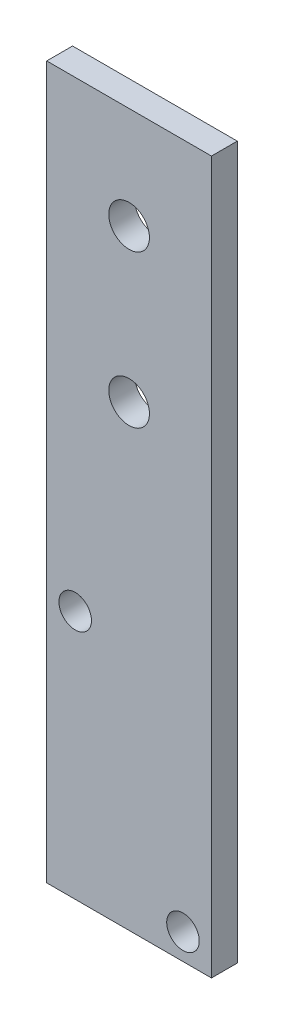
ISO-10303-21;
HEADER;
FILE_DESCRIPTION(('STEP AP214'),'2;1');
FILE_NAME('part.step','',(''),(''),'','','');
FILE_SCHEMA(('AUTOMOTIVE_DESIGN { 1 0 10303 214 1 1 1 1 }'));
ENDSEC;
DATA;
#1=APPLICATION_CONTEXT('core data for automotive mechanical design processes');
#2=APPLICATION_PROTOCOL_DEFINITION('international standard','automotive_design',2000,#1);
#3=PRODUCT_CONTEXT('',#1,'mechanical');
#4=PRODUCT('Part','Part','',(#3));
#5=PRODUCT_RELATED_PRODUCT_CATEGORY('part','',(#4));
#6=PRODUCT_DEFINITION_FORMATION('','',#4);
#7=PRODUCT_DEFINITION_CONTEXT('part definition',#1,'design');
#8=PRODUCT_DEFINITION('design','',#6,#7);
#9=PRODUCT_DEFINITION_SHAPE('','',#8);
#10=(LENGTH_UNIT() NAMED_UNIT(*) SI_UNIT(.MILLI.,.METRE.));
#11=(NAMED_UNIT(*) PLANE_ANGLE_UNIT() SI_UNIT($,.RADIAN.));
#12=(NAMED_UNIT(*) SI_UNIT($,.STERADIAN.) SOLID_ANGLE_UNIT());
#13=UNCERTAINTY_MEASURE_WITH_UNIT(LENGTH_MEASURE(1.E-05),#10,'distance_accuracy_value','');
#14=(GEOMETRIC_REPRESENTATION_CONTEXT(3) GLOBAL_UNCERTAINTY_ASSIGNED_CONTEXT((#13)) GLOBAL_UNIT_ASSIGNED_CONTEXT((#10,
#11,#12)) REPRESENTATION_CONTEXT('',''));
#15=CARTESIAN_POINT('',(0.,0.,0.));
#16=DIRECTION('',(0.,0.,1.));
#17=DIRECTION('',(1.,0.,0.));
#18=AXIS2_PLACEMENT_3D('',#15,#16,#17);
#19=CARTESIAN_POINT('',(0.,0.,2.54));
#20=DIRECTION('',(1.,0.,0.));
#21=DIRECTION('',(0.,0.,-1.));
#22=AXIS2_PLACEMENT_3D('',#19,#20,#21);
#23=PLANE('',#22);
#24=DIRECTION('',(0.,-1.,0.));
#25=VECTOR('',#24,1.);
#26=CARTESIAN_POINT('',(0.,0.,0.));
#27=LINE('',#26,#25);
#28=CARTESIAN_POINT('',(0.,70.,0.));
#29=VERTEX_POINT('',#28);
#30=CARTESIAN_POINT('',(0.,0.,0.));
#31=VERTEX_POINT('',#30);
#32=EDGE_CURVE('E96',#29,#31,#27,.T.);
#33=ORIENTED_EDGE('',*,*,#32,.T.);
#34=DIRECTION('',(0.,0.,-1.));
#35=VECTOR('',#34,1.);
#36=CARTESIAN_POINT('',(0.,0.,2.54));
#37=LINE('',#36,#35);
#38=CARTESIAN_POINT('',(0.,0.,2.54));
#39=VERTEX_POINT('',#38);
#40=EDGE_CURVE('E11',#39,#31,#37,.T.);
#41=ORIENTED_EDGE('',*,*,#40,.F.);
#42=DIRECTION('',(0.,-1.,0.));
#43=VECTOR('',#42,1.);
#44=CARTESIAN_POINT('',(0.,0.,2.54));
#45=LINE('',#44,#43);
#46=CARTESIAN_POINT('',(0.,70.,2.54));
#47=VERTEX_POINT('',#46);
#48=EDGE_CURVE('E84',#47,#39,#45,.T.);
#49=ORIENTED_EDGE('',*,*,#48,.F.);
#50=DIRECTION('',(0.,0.,-1.));
#51=VECTOR('',#50,1.);
#52=CARTESIAN_POINT('',(0.,70.,2.54));
#53=LINE('',#52,#51);
#54=EDGE_CURVE('E92',#47,#29,#53,.T.);
#55=ORIENTED_EDGE('',*,*,#54,.T.);
#56=EDGE_LOOP('',(#33,#41,#49,#55));
#57=FACE_BOUND('',#56,.T.);
#58=ADVANCED_FACE('F33',(#57),#23,.F.);
#59=CARTESIAN_POINT('',(0.,0.,2.54));
#60=DIRECTION('',(0.,1.,0.));
#61=DIRECTION('',(0.,0.,1.));
#62=AXIS2_PLACEMENT_3D('',#59,#60,#61);
#63=PLANE('',#62);
#64=DIRECTION('',(1.,0.,0.));
#65=VECTOR('',#64,1.);
#66=CARTESIAN_POINT('',(0.,0.,0.));
#67=LINE('',#66,#65);
#68=CARTESIAN_POINT('',(16.2,0.,0.));
#69=VERTEX_POINT('',#68);
#70=EDGE_CURVE('E88',#31,#69,#67,.T.);
#71=ORIENTED_EDGE('',*,*,#70,.T.);
#72=DIRECTION('',(0.,0.,-1.));
#73=VECTOR('',#72,1.);
#74=CARTESIAN_POINT('',(16.2,0.,2.54));
#75=LINE('',#74,#73);
#76=CARTESIAN_POINT('',(16.2,0.,2.54));
#77=VERTEX_POINT('',#76);
#78=EDGE_CURVE('E41',#77,#69,#75,.T.);
#79=ORIENTED_EDGE('',*,*,#78,.F.);
#80=DIRECTION('',(1.,0.,0.));
#81=VECTOR('',#80,1.);
#82=CARTESIAN_POINT('',(0.,0.,2.54));
#83=LINE('',#82,#81);
#84=EDGE_CURVE('E79',#39,#77,#83,.T.);
#85=ORIENTED_EDGE('',*,*,#84,.F.);
#86=ORIENTED_EDGE('',*,*,#40,.T.);
#87=EDGE_LOOP('',(#71,#79,#85,#86));
#88=FACE_BOUND('',#87,.T.);
#89=ADVANCED_FACE('F87',(#88),#63,.F.);
#90=CARTESIAN_POINT('',(16.2,0.,2.54));
#91=DIRECTION('',(-1.,0.,0.));
#92=DIRECTION('',(0.,0.,1.));
#93=AXIS2_PLACEMENT_3D('',#90,#91,#92);
#94=PLANE('',#93);
#95=DIRECTION('',(0.,1.,0.));
#96=VECTOR('',#95,1.);
#97=CARTESIAN_POINT('',(16.2,0.,0.));
#98=LINE('',#97,#96);
#99=CARTESIAN_POINT('',(16.2,70.,0.));
#100=VERTEX_POINT('',#99);
#101=EDGE_CURVE('E66',#69,#100,#98,.T.);
#102=ORIENTED_EDGE('',*,*,#101,.T.);
#103=DIRECTION('',(0.,0.,-1.));
#104=VECTOR('',#103,1.);
#105=CARTESIAN_POINT('',(16.2,70.,2.54));
#106=LINE('',#105,#104);
#107=CARTESIAN_POINT('',(16.2,70.,2.54));
#108=VERTEX_POINT('',#107);
#109=EDGE_CURVE('E89',#108,#100,#106,.T.);
#110=ORIENTED_EDGE('',*,*,#109,.F.);
#111=DIRECTION('',(0.,1.,0.));
#112=VECTOR('',#111,1.);
#113=CARTESIAN_POINT('',(16.2,0.,2.54));
#114=LINE('',#113,#112);
#115=EDGE_CURVE('E82',#77,#108,#114,.T.);
#116=ORIENTED_EDGE('',*,*,#115,.F.);
#117=ORIENTED_EDGE('',*,*,#78,.T.);
#118=EDGE_LOOP('',(#102,#110,#116,#117));
#119=FACE_BOUND('',#118,.T.);
#120=ADVANCED_FACE('F90',(#119),#94,.F.);
#121=CARTESIAN_POINT('',(0.,70.,2.54));
#122=DIRECTION('',(0.,-1.,0.));
#123=DIRECTION('',(0.,0.,-1.));
#124=AXIS2_PLACEMENT_3D('',#121,#122,#123);
#125=PLANE('',#124);
#126=DIRECTION('',(-1.,0.,0.));
#127=VECTOR('',#126,1.);
#128=CARTESIAN_POINT('',(0.,70.,0.));
#129=LINE('',#128,#127);
#130=EDGE_CURVE('E72',#100,#29,#129,.T.);
#131=ORIENTED_EDGE('',*,*,#130,.T.);
#132=ORIENTED_EDGE('',*,*,#54,.F.);
#133=DIRECTION('',(-1.,0.,0.));
#134=VECTOR('',#133,1.);
#135=CARTESIAN_POINT('',(0.,70.,2.54));
#136=LINE('',#135,#134);
#137=EDGE_CURVE('E49',#108,#47,#136,.T.);
#138=ORIENTED_EDGE('',*,*,#137,.F.);
#139=ORIENTED_EDGE('',*,*,#109,.T.);
#140=EDGE_LOOP('',(#131,#132,#138,#139));
#141=FACE_BOUND('',#140,.T.);
#142=ADVANCED_FACE('F104',(#141),#125,.F.);
#143=CARTESIAN_POINT('',(0.,0.,2.54));
#144=DIRECTION('',(0.,0.,-1.));
#145=DIRECTION('',(-1.,0.,0.));
#146=AXIS2_PLACEMENT_3D('',#143,#144,#145);
#147=PLANE('',#146);
#148=CARTESIAN_POINT('',(8.1,45.,2.54));
#149=DIRECTION('',(0.,0.,1.));
#150=DIRECTION('',(1.,0.,0.));
#151=AXIS2_PLACEMENT_3D('',#148,#149,#150);
#152=CIRCLE('',#151,2.);
#153=CARTESIAN_POINT('',(10.1,45.,2.54));
#154=VERTEX_POINT('',#153);
#155=EDGE_CURVE('E128',#154,#154,#152,.T.);
#156=ORIENTED_EDGE('',*,*,#155,.F.);
#157=EDGE_LOOP('',(#156));
#158=FACE_BOUND('',#157,.T.);
#159=CARTESIAN_POINT('',(8.1,60.,2.54));
#160=DIRECTION('',(0.,0.,1.));
#161=DIRECTION('',(1.,0.,0.));
#162=AXIS2_PLACEMENT_3D('',#159,#160,#161);
#163=CIRCLE('',#162,2.);
#164=CARTESIAN_POINT('',(10.1,60.,2.54));
#165=VERTEX_POINT('',#164);
#166=EDGE_CURVE('E122',#165,#165,#163,.T.);
#167=ORIENTED_EDGE('',*,*,#166,.F.);
#168=EDGE_LOOP('',(#167));
#169=FACE_BOUND('',#168,.T.);
#170=CARTESIAN_POINT('',(2.80000000000001,24.54,2.54));
#171=DIRECTION('',(0.,0.,-1.));
#172=DIRECTION('',(1.,0.,0.));
#173=AXIS2_PLACEMENT_3D('',#170,#171,#172);
#174=CIRCLE('',#173,1.6);
#175=CARTESIAN_POINT('',(4.40000000000001,24.54,2.54));
#176=VERTEX_POINT('',#175);
#177=EDGE_CURVE('E113',#176,#176,#174,.T.);
#178=ORIENTED_EDGE('',*,*,#177,.T.);
#179=EDGE_LOOP('',(#178));
#180=FACE_BOUND('',#179,.T.);
#181=CARTESIAN_POINT('',(13.4,2.54,2.54));
#182=DIRECTION('',(0.,0.,-1.));
#183=DIRECTION('',(1.,0.,0.));
#184=AXIS2_PLACEMENT_3D('',#181,#182,#183);
#185=CIRCLE('',#184,1.6);
#186=CARTESIAN_POINT('',(15.,2.54,2.54));
#187=VERTEX_POINT('',#186);
#188=EDGE_CURVE('E99',#187,#187,#185,.T.);
#189=ORIENTED_EDGE('',*,*,#188,.T.);
#190=EDGE_LOOP('',(#189));
#191=FACE_BOUND('',#190,.T.);
#192=ORIENTED_EDGE('',*,*,#48,.T.);
#193=ORIENTED_EDGE('',*,*,#84,.T.);
#194=ORIENTED_EDGE('',*,*,#115,.T.);
#195=ORIENTED_EDGE('',*,*,#137,.T.);
#196=EDGE_LOOP('',(#192,#193,#194,#195));
#197=FACE_BOUND('',#196,.T.);
#198=ADVANCED_FACE('F80',(#158,#169,#180,#191,#197),#147,.F.);
#199=CARTESIAN_POINT('',(0.,0.,0.));
#200=DIRECTION('',(0.,0.,-1.));
#201=DIRECTION('',(-1.,0.,0.));
#202=AXIS2_PLACEMENT_3D('',#199,#200,#201);
#203=PLANE('',#202);
#204=CARTESIAN_POINT('',(8.1,45.,0.));
#205=DIRECTION('',(0.,0.,1.));
#206=DIRECTION('',(1.,0.,0.));
#207=AXIS2_PLACEMENT_3D('',#204,#205,#206);
#208=CIRCLE('',#207,2.);
#209=CARTESIAN_POINT('',(10.1,45.,0.));
#210=VERTEX_POINT('',#209);
#211=EDGE_CURVE('E125',#210,#210,#208,.T.);
#212=ORIENTED_EDGE('',*,*,#211,.T.);
#213=EDGE_LOOP('',(#212));
#214=FACE_BOUND('',#213,.T.);
#215=CARTESIAN_POINT('',(8.1,60.,0.));
#216=DIRECTION('',(0.,0.,1.));
#217=DIRECTION('',(1.,0.,0.));
#218=AXIS2_PLACEMENT_3D('',#215,#216,#217);
#219=CIRCLE('',#218,2.);
#220=CARTESIAN_POINT('',(10.1,60.,0.));
#221=VERTEX_POINT('',#220);
#222=EDGE_CURVE('E119',#221,#221,#219,.T.);
#223=ORIENTED_EDGE('',*,*,#222,.T.);
#224=EDGE_LOOP('',(#223));
#225=FACE_BOUND('',#224,.T.);
#226=CARTESIAN_POINT('',(2.80000000000001,24.54,0.));
#227=DIRECTION('',(0.,0.,-1.));
#228=DIRECTION('',(1.,0.,0.));
#229=AXIS2_PLACEMENT_3D('',#226,#227,#228);
#230=CIRCLE('',#229,1.6);
#231=CARTESIAN_POINT('',(4.40000000000001,24.54,0.));
#232=VERTEX_POINT('',#231);
#233=EDGE_CURVE('E116',#232,#232,#230,.T.);
#234=ORIENTED_EDGE('',*,*,#233,.F.);
#235=EDGE_LOOP('',(#234));
#236=FACE_BOUND('',#235,.T.);
#237=CARTESIAN_POINT('',(13.4,2.54,0.));
#238=DIRECTION('',(0.,0.,-1.));
#239=DIRECTION('',(1.,0.,0.));
#240=AXIS2_PLACEMENT_3D('',#237,#238,#239);
#241=CIRCLE('',#240,1.6);
#242=CARTESIAN_POINT('',(15.,2.54,0.));
#243=VERTEX_POINT('',#242);
#244=EDGE_CURVE('E110',#243,#243,#241,.T.);
#245=ORIENTED_EDGE('',*,*,#244,.F.);
#246=EDGE_LOOP('',(#245));
#247=FACE_BOUND('',#246,.T.);
#248=ORIENTED_EDGE('',*,*,#32,.F.);
#249=ORIENTED_EDGE('',*,*,#130,.F.);
#250=ORIENTED_EDGE('',*,*,#101,.F.);
#251=ORIENTED_EDGE('',*,*,#70,.F.);
#252=EDGE_LOOP('',(#248,#249,#250,#251));
#253=FACE_BOUND('',#252,.T.);
#254=ADVANCED_FACE('F107',(#214,#225,#236,#247,#253),#203,.T.);
#255=CARTESIAN_POINT('',(13.4,2.54,2.54));
#256=DIRECTION('',(0.,0.,-1.));
#257=DIRECTION('',(-1.,0.,0.));
#258=AXIS2_PLACEMENT_3D('',#255,#256,#257);
#259=CYLINDRICAL_SURFACE('',#258,1.6);
#260=ORIENTED_EDGE('',*,*,#188,.F.);
#261=EDGE_LOOP('',(#260));
#262=FACE_BOUND('',#261,.T.);
#263=ORIENTED_EDGE('',*,*,#244,.T.);
#264=EDGE_LOOP('',(#263));
#265=FACE_BOUND('',#264,.T.);
#266=ADVANCED_FACE('F152',(#262,#265),#259,.F.);
#267=CARTESIAN_POINT('',(2.80000000000001,24.54,2.54));
#268=DIRECTION('',(0.,0.,-1.));
#269=DIRECTION('',(-1.,0.,0.));
#270=AXIS2_PLACEMENT_3D('',#267,#268,#269);
#271=CYLINDRICAL_SURFACE('',#270,1.6);
#272=ORIENTED_EDGE('',*,*,#177,.F.);
#273=EDGE_LOOP('',(#272));
#274=FACE_BOUND('',#273,.T.);
#275=ORIENTED_EDGE('',*,*,#233,.T.);
#276=EDGE_LOOP('',(#275));
#277=FACE_BOUND('',#276,.T.);
#278=ADVANCED_FACE('F155',(#274,#277),#271,.F.);
#279=CARTESIAN_POINT('',(8.1,60.,0.));
#280=DIRECTION('',(0.,0.,1.));
#281=DIRECTION('',(1.,0.,0.));
#282=AXIS2_PLACEMENT_3D('',#279,#280,#281);
#283=CYLINDRICAL_SURFACE('',#282,2.);
#284=ORIENTED_EDGE('',*,*,#222,.F.);
#285=EDGE_LOOP('',(#284));
#286=FACE_BOUND('',#285,.T.);
#287=ORIENTED_EDGE('',*,*,#166,.T.);
#288=EDGE_LOOP('',(#287));
#289=FACE_BOUND('',#288,.T.);
#290=ADVANCED_FACE('F139',(#286,#289),#283,.F.);
#291=CARTESIAN_POINT('',(8.1,45.,0.));
#292=DIRECTION('',(0.,0.,1.));
#293=DIRECTION('',(1.,0.,0.));
#294=AXIS2_PLACEMENT_3D('',#291,#292,#293);
#295=CYLINDRICAL_SURFACE('',#294,2.);
#296=ORIENTED_EDGE('',*,*,#211,.F.);
#297=EDGE_LOOP('',(#296));
#298=FACE_BOUND('',#297,.T.);
#299=ORIENTED_EDGE('',*,*,#155,.T.);
#300=EDGE_LOOP('',(#299));
#301=FACE_BOUND('',#300,.T.);
#302=ADVANCED_FACE('F136',(#298,#301),#295,.F.);
#303=CLOSED_SHELL('',(#58,#89,#120,#142,#198,#254,#266,#278,#290,#302));
#304=MANIFOLD_SOLID_BREP('B2',#303);
#305=ADVANCED_BREP_SHAPE_REPRESENTATION('',(#18,#304),#14);
#306=SHAPE_DEFINITION_REPRESENTATION(#9,#305);
ENDSEC;
END-ISO-10303-21;
